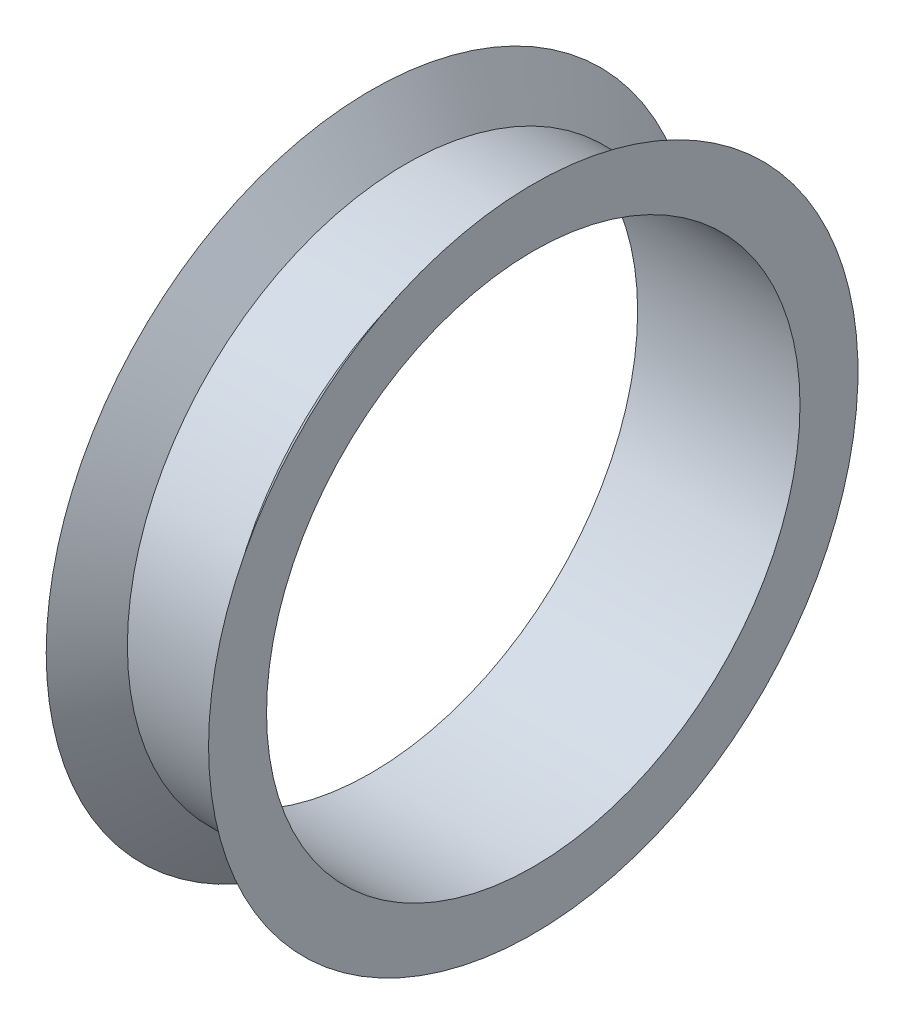
ISO-10303-21;
HEADER;
FILE_DESCRIPTION(('STEP AP214'),'2;1');
FILE_NAME('part.step','',(''),(''),'','','');
FILE_SCHEMA(('AUTOMOTIVE_DESIGN { 1 0 10303 214 1 1 1 1 }'));
ENDSEC;
DATA;
#1=APPLICATION_CONTEXT('core data for automotive mechanical design processes');
#2=APPLICATION_PROTOCOL_DEFINITION('international standard','automotive_design',2000,#1);
#3=PRODUCT_CONTEXT('',#1,'mechanical');
#4=PRODUCT('Part','Part','',(#3));
#5=PRODUCT_RELATED_PRODUCT_CATEGORY('part','',(#4));
#6=PRODUCT_DEFINITION_FORMATION('','',#4);
#7=PRODUCT_DEFINITION_CONTEXT('part definition',#1,'design');
#8=PRODUCT_DEFINITION('design','',#6,#7);
#9=PRODUCT_DEFINITION_SHAPE('','',#8);
#10=(LENGTH_UNIT() NAMED_UNIT(*) SI_UNIT(.MILLI.,.METRE.));
#11=(NAMED_UNIT(*) PLANE_ANGLE_UNIT() SI_UNIT($,.RADIAN.));
#12=(NAMED_UNIT(*) SI_UNIT($,.STERADIAN.) SOLID_ANGLE_UNIT());
#13=UNCERTAINTY_MEASURE_WITH_UNIT(LENGTH_MEASURE(1.E-05),#10,'distance_accuracy_value','');
#14=(GEOMETRIC_REPRESENTATION_CONTEXT(3) GLOBAL_UNCERTAINTY_ASSIGNED_CONTEXT((#13)) GLOBAL_UNIT_ASSIGNED_CONTEXT((#10,
#11,#12)) REPRESENTATION_CONTEXT('',''));
#15=CARTESIAN_POINT('',(0.,0.,0.));
#16=DIRECTION('',(0.,0.,1.));
#17=DIRECTION('',(1.,0.,0.));
#18=AXIS2_PLACEMENT_3D('',#15,#16,#17);
#19=CARTESIAN_POINT('',(-2.19693066659961,0.,-5.38141867473576));
#20=DIRECTION('',(1.,0.,0.));
#21=DIRECTION('',(0.,0.,-1.));
#22=AXIS2_PLACEMENT_3D('',#19,#20,#21);
#23=PLANE('',#22);
#24=CARTESIAN_POINT('',(-2.19693066659961,0.,5.61858132526425));
#25=DIRECTION('',(1.,0.,0.));
#26=DIRECTION('',(0.,0.,-1.));
#27=AXIS2_PLACEMENT_3D('',#24,#25,#26);
#28=CIRCLE('',#27,11.5);
#29=CARTESIAN_POINT('',(-2.19693066659961,0.,-5.88141867473575));
#30=VERTEX_POINT('',#29);
#31=EDGE_CURVE('E50',#30,#30,#28,.T.);
#32=ORIENTED_EDGE('',*,*,#31,.T.);
#33=EDGE_LOOP('',(#32));
#34=FACE_BOUND('',#33,.T.);
#35=CARTESIAN_POINT('',(-2.19693066659961,0.,5.61858132526425));
#36=DIRECTION('',(-1.,0.,0.));
#37=DIRECTION('',(0.,0.,1.));
#38=AXIS2_PLACEMENT_3D('',#35,#36,#37);
#39=CIRCLE('',#38,14.);
#40=CARTESIAN_POINT('',(-2.19693066659961,0.,19.6185813252642));
#41=VERTEX_POINT('',#40);
#42=EDGE_CURVE('E10',#41,#41,#39,.T.);
#43=ORIENTED_EDGE('',*,*,#42,.T.);
#44=EDGE_LOOP('',(#43));
#45=FACE_BOUND('',#44,.T.);
#46=ADVANCED_FACE('F31',(#34,#45),#23,.F.);
#47=CARTESIAN_POINT('',(-0.696930666599613,0.,5.61858132526425));
#48=DIRECTION('',(-1.,0.,0.));
#49=DIRECTION('',(0.,0.,1.));
#50=AXIS2_PLACEMENT_3D('',#47,#48,#49);
#51=CONICAL_SURFACE('',#50,12.,0.927295218001612);
#52=ORIENTED_EDGE('',*,*,#42,.F.);
#53=EDGE_LOOP('',(#52));
#54=FACE_BOUND('',#53,.T.);
#55=CARTESIAN_POINT('',(-0.696930666599613,0.,5.61858132526425));
#56=DIRECTION('',(-1.,0.,0.));
#57=DIRECTION('',(0.,0.,1.));
#58=AXIS2_PLACEMENT_3D('',#55,#56,#57);
#59=CIRCLE('',#58,12.);
#60=CARTESIAN_POINT('',(-0.696930666599613,0.,17.6185813252642));
#61=VERTEX_POINT('',#60);
#62=EDGE_CURVE('E37',#61,#61,#59,.T.);
#63=ORIENTED_EDGE('',*,*,#62,.T.);
#64=EDGE_LOOP('',(#63));
#65=FACE_BOUND('',#64,.T.);
#66=ADVANCED_FACE('F75',(#54,#65),#51,.T.);
#67=CARTESIAN_POINT('',(-2.19693066659961,0.,5.61858132526425));
#68=DIRECTION('',(-1.,0.,0.));
#69=DIRECTION('',(0.,0.,1.));
#70=AXIS2_PLACEMENT_3D('',#67,#68,#69);
#71=CYLINDRICAL_SURFACE('',#70,12.);
#72=ORIENTED_EDGE('',*,*,#62,.F.);
#73=EDGE_LOOP('',(#72));
#74=FACE_BOUND('',#73,.T.);
#75=CARTESIAN_POINT('',(3.30306933340038,0.,5.61858132526425));
#76=DIRECTION('',(-1.,0.,0.));
#77=DIRECTION('',(0.,0.,1.));
#78=AXIS2_PLACEMENT_3D('',#75,#76,#77);
#79=CIRCLE('',#78,12.);
#80=CARTESIAN_POINT('',(3.30306933340038,0.,17.6185813252642));
#81=VERTEX_POINT('',#80);
#82=EDGE_CURVE('E41',#81,#81,#79,.T.);
#83=ORIENTED_EDGE('',*,*,#82,.T.);
#84=EDGE_LOOP('',(#83));
#85=FACE_BOUND('',#84,.T.);
#86=ADVANCED_FACE('F68',(#74,#85),#71,.T.);
#87=CARTESIAN_POINT('',(4.80306933340039,0.,5.61858132526425));
#88=DIRECTION('',(1.,0.,0.));
#89=DIRECTION('',(0.,0.,-1.));
#90=AXIS2_PLACEMENT_3D('',#87,#88,#89);
#91=CONICAL_SURFACE('',#90,14.,0.927295218001612);
#92=ORIENTED_EDGE('',*,*,#82,.F.);
#93=EDGE_LOOP('',(#92));
#94=FACE_BOUND('',#93,.T.);
#95=CARTESIAN_POINT('',(4.80306933340039,0.,5.61858132526425));
#96=DIRECTION('',(-1.,0.,0.));
#97=DIRECTION('',(0.,0.,1.));
#98=AXIS2_PLACEMENT_3D('',#95,#96,#97);
#99=CIRCLE('',#98,14.);
#100=CARTESIAN_POINT('',(4.80306933340039,0.,19.6185813252642));
#101=VERTEX_POINT('',#100);
#102=EDGE_CURVE('E45',#101,#101,#99,.T.);
#103=ORIENTED_EDGE('',*,*,#102,.T.);
#104=EDGE_LOOP('',(#103));
#105=FACE_BOUND('',#104,.T.);
#106=ADVANCED_FACE('F63',(#94,#105),#91,.T.);
#107=CARTESIAN_POINT('',(4.80306933340039,0.,-8.38141867473576));
#108=DIRECTION('',(-1.,0.,0.));
#109=DIRECTION('',(0.,0.,1.));
#110=AXIS2_PLACEMENT_3D('',#107,#108,#109);
#111=PLANE('',#110);
#112=CARTESIAN_POINT('',(4.80306933340039,0.,5.61858132526425));
#113=DIRECTION('',(1.,0.,0.));
#114=DIRECTION('',(0.,0.,-1.));
#115=AXIS2_PLACEMENT_3D('',#112,#113,#114);
#116=CIRCLE('',#115,11.5);
#117=CARTESIAN_POINT('',(4.80306933340039,0.,-5.88141867473575));
#118=VERTEX_POINT('',#117);
#119=EDGE_CURVE('E53',#118,#118,#116,.T.);
#120=ORIENTED_EDGE('',*,*,#119,.F.);
#121=EDGE_LOOP('',(#120));
#122=FACE_BOUND('',#121,.T.);
#123=ORIENTED_EDGE('',*,*,#102,.F.);
#124=EDGE_LOOP('',(#123));
#125=FACE_BOUND('',#124,.T.);
#126=ADVANCED_FACE('F60',(#122,#125),#111,.F.);
#127=CARTESIAN_POINT('',(-5.19693066659961,0.,5.61858132526425));
#128=DIRECTION('',(1.,0.,0.));
#129=DIRECTION('',(0.,0.,-1.));
#130=AXIS2_PLACEMENT_3D('',#127,#128,#129);
#131=CYLINDRICAL_SURFACE('',#130,11.5);
#132=ORIENTED_EDGE('',*,*,#119,.T.);
#133=EDGE_LOOP('',(#132));
#134=FACE_BOUND('',#133,.T.);
#135=ORIENTED_EDGE('',*,*,#31,.F.);
#136=EDGE_LOOP('',(#135));
#137=FACE_BOUND('',#136,.T.);
#138=ADVANCED_FACE('F57',(#134,#137),#131,.F.);
#139=CLOSED_SHELL('',(#46,#66,#86,#106,#126,#138));
#140=MANIFOLD_SOLID_BREP('B2',#139);
#141=ADVANCED_BREP_SHAPE_REPRESENTATION('',(#18,#140),#14);
#142=SHAPE_DEFINITION_REPRESENTATION(#9,#141);
ENDSEC;
END-ISO-10303-21;
